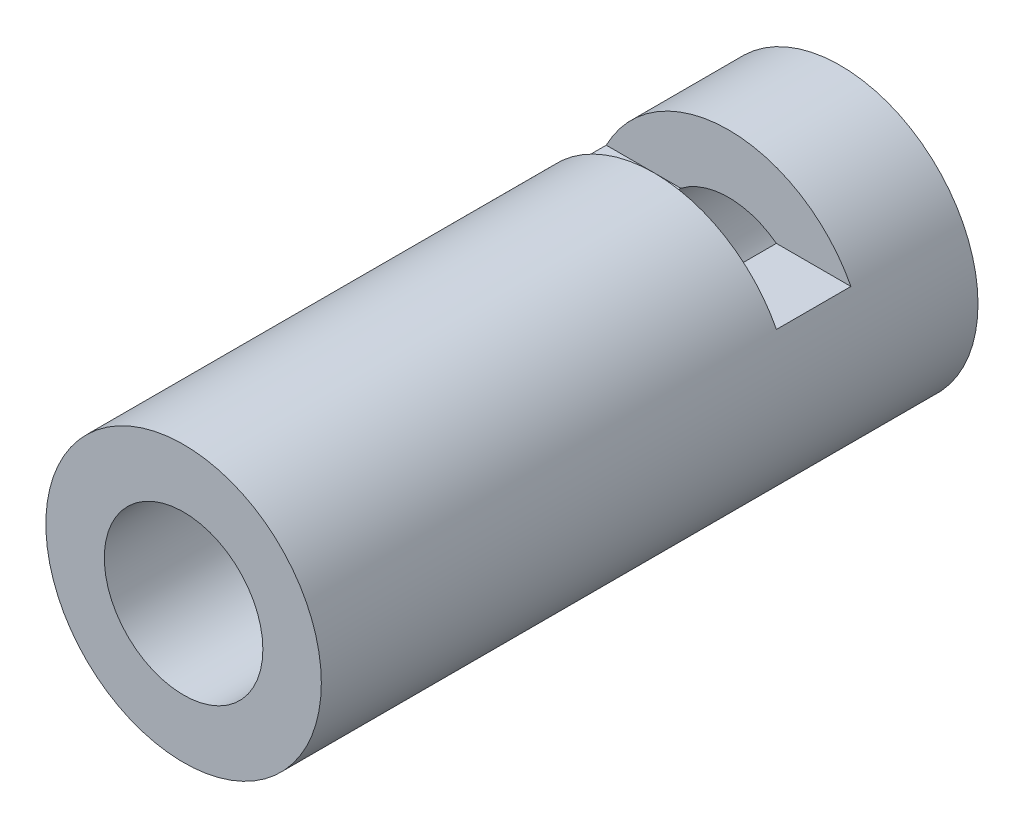
ISO-10303-21;
HEADER;
FILE_DESCRIPTION(('STEP AP214'),'2;1');
FILE_NAME('part.step','',(''),(''),'','','');
FILE_SCHEMA(('AUTOMOTIVE_DESIGN { 1 0 10303 214 1 1 1 1 }'));
ENDSEC;
DATA;
#1=APPLICATION_CONTEXT('core data for automotive mechanical design processes');
#2=APPLICATION_PROTOCOL_DEFINITION('international standard','automotive_design',2000,#1);
#3=PRODUCT_CONTEXT('',#1,'mechanical');
#4=PRODUCT('Part','Part','',(#3));
#5=PRODUCT_RELATED_PRODUCT_CATEGORY('part','',(#4));
#6=PRODUCT_DEFINITION_FORMATION('','',#4);
#7=PRODUCT_DEFINITION_CONTEXT('part definition',#1,'design');
#8=PRODUCT_DEFINITION('design','',#6,#7);
#9=PRODUCT_DEFINITION_SHAPE('','',#8);
#10=(LENGTH_UNIT() NAMED_UNIT(*) SI_UNIT(.MILLI.,.METRE.));
#11=(NAMED_UNIT(*) PLANE_ANGLE_UNIT() SI_UNIT($,.RADIAN.));
#12=(NAMED_UNIT(*) SI_UNIT($,.STERADIAN.) SOLID_ANGLE_UNIT());
#13=UNCERTAINTY_MEASURE_WITH_UNIT(LENGTH_MEASURE(1.E-05),#10,'distance_accuracy_value','');
#14=(GEOMETRIC_REPRESENTATION_CONTEXT(3) GLOBAL_UNCERTAINTY_ASSIGNED_CONTEXT((#13)) GLOBAL_UNIT_ASSIGNED_CONTEXT((#10,
#11,#12)) REPRESENTATION_CONTEXT('',''));
#15=CARTESIAN_POINT('',(0.,0.,0.));
#16=DIRECTION('',(0.,0.,1.));
#17=DIRECTION('',(1.,0.,0.));
#18=AXIS2_PLACEMENT_3D('',#15,#16,#17);
#19=CARTESIAN_POINT('',(0.,0.,88.2));
#20=DIRECTION('',(0.,0.,1.));
#21=DIRECTION('',(1.,0.,0.));
#22=AXIS2_PLACEMENT_3D('',#19,#20,#21);
#23=PLANE('',#22);
#24=CARTESIAN_POINT('',(0.,0.,88.2));
#25=DIRECTION('',(0.,0.,1.));
#26=DIRECTION('',(1.,0.,0.));
#27=AXIS2_PLACEMENT_3D('',#24,#25,#26);
#28=CIRCLE('',#27,18.5);
#29=CARTESIAN_POINT('',(18.5,0.,88.2));
#30=VERTEX_POINT('',#29);
#31=EDGE_CURVE('E80',#30,#30,#28,.T.);
#32=ORIENTED_EDGE('',*,*,#31,.T.);
#33=EDGE_LOOP('',(#32));
#34=FACE_BOUND('',#33,.T.);
#35=CARTESIAN_POINT('',(0.,0.,88.2));
#36=DIRECTION('',(0.,0.,1.));
#37=DIRECTION('',(1.,0.,0.));
#38=AXIS2_PLACEMENT_3D('',#35,#36,#37);
#39=CIRCLE('',#38,10.65);
#40=CARTESIAN_POINT('',(10.65,0.,88.2));
#41=VERTEX_POINT('',#40);
#42=EDGE_CURVE('E97',#41,#41,#39,.T.);
#43=ORIENTED_EDGE('',*,*,#42,.F.);
#44=EDGE_LOOP('',(#43));
#45=FACE_BOUND('',#44,.T.);
#46=ADVANCED_FACE('F32',(#34,#45),#23,.T.);
#47=CARTESIAN_POINT('',(0.,0.,0.));
#48=DIRECTION('',(0.,0.,1.));
#49=DIRECTION('',(1.,0.,0.));
#50=AXIS2_PLACEMENT_3D('',#47,#48,#49);
#51=PLANE('',#50);
#52=CARTESIAN_POINT('',(0.,0.,0.));
#53=DIRECTION('',(0.,0.,1.));
#54=DIRECTION('',(1.,0.,0.));
#55=AXIS2_PLACEMENT_3D('',#52,#53,#54);
#56=CIRCLE('',#55,18.5);
#57=CARTESIAN_POINT('',(18.5,0.,0.));
#58=VERTEX_POINT('',#57);
#59=EDGE_CURVE('E94',#58,#58,#56,.T.);
#60=ORIENTED_EDGE('',*,*,#59,.F.);
#61=EDGE_LOOP('',(#60));
#62=FACE_BOUND('',#61,.T.);
#63=CARTESIAN_POINT('',(0.,0.,0.));
#64=DIRECTION('',(0.,0.,1.));
#65=DIRECTION('',(1.,0.,0.));
#66=AXIS2_PLACEMENT_3D('',#63,#64,#65);
#67=CIRCLE('',#66,10.65);
#68=CARTESIAN_POINT('',(10.65,0.,0.));
#69=VERTEX_POINT('',#68);
#70=EDGE_CURVE('E100',#69,#69,#67,.T.);
#71=ORIENTED_EDGE('',*,*,#70,.T.);
#72=EDGE_LOOP('',(#71));
#73=FACE_BOUND('',#72,.T.);
#74=ADVANCED_FACE('F128',(#62,#73),#51,.F.);
#75=CARTESIAN_POINT('',(0.,0.,88.2));
#76=DIRECTION('',(0.,0.,-1.));
#77=DIRECTION('',(-1.,0.,0.));
#78=AXIS2_PLACEMENT_3D('',#75,#76,#77);
#79=CYLINDRICAL_SURFACE('',#78,18.5);
#80=DIRECTION('',(0.,0.,-1.));
#81=VECTOR('',#80,1.);
#82=CARTESIAN_POINT('',(16.431676725155,8.49999999999999,88.2));
#83=LINE('',#82,#81);
#84=CARTESIAN_POINT('',(16.431676725155,8.5,15.));
#85=VERTEX_POINT('',#84);
#86=CARTESIAN_POINT('',(16.431676725155,8.5,25.));
#87=VERTEX_POINT('',#86);
#88=EDGE_CURVE('E108',#85,#87,#83,.F.);
#89=ORIENTED_EDGE('',*,*,#88,.T.);
#90=CARTESIAN_POINT('',(0.,0.,25.));
#91=DIRECTION('',(0.,0.,1.));
#92=DIRECTION('',(0.,-1.,0.));
#93=AXIS2_PLACEMENT_3D('',#90,#91,#92);
#94=CIRCLE('',#93,18.5);
#95=CARTESIAN_POINT('',(-16.431676725155,8.5,25.));
#96=VERTEX_POINT('',#95);
#97=EDGE_CURVE('E47',#87,#96,#94,.T.);
#98=ORIENTED_EDGE('',*,*,#97,.T.);
#99=DIRECTION('',(0.,0.,-1.));
#100=VECTOR('',#99,1.);
#101=CARTESIAN_POINT('',(-16.431676725155,8.49999999999999,88.2));
#102=LINE('',#101,#100);
#103=CARTESIAN_POINT('',(-16.431676725155,8.5,15.));
#104=VERTEX_POINT('',#103);
#105=EDGE_CURVE('E86',#96,#104,#102,.T.);
#106=ORIENTED_EDGE('',*,*,#105,.T.);
#107=CARTESIAN_POINT('',(0.,0.,15.));
#108=DIRECTION('',(0.,0.,-1.));
#109=DIRECTION('',(0.,1.,0.));
#110=AXIS2_PLACEMENT_3D('',#107,#108,#109);
#111=CIRCLE('',#110,18.5);
#112=EDGE_CURVE('E103',#104,#85,#111,.T.);
#113=ORIENTED_EDGE('',*,*,#112,.T.);
#114=EDGE_LOOP('',(#89,#98,#106,#113));
#115=FACE_BOUND('',#114,.T.);
#116=ORIENTED_EDGE('',*,*,#31,.F.);
#117=EDGE_LOOP('',(#116));
#118=FACE_BOUND('',#117,.T.);
#119=ORIENTED_EDGE('',*,*,#59,.T.);
#120=EDGE_LOOP('',(#119));
#121=FACE_BOUND('',#120,.T.);
#122=ADVANCED_FACE('F34',(#115,#118,#121),#79,.T.);
#123=CARTESIAN_POINT('',(0.,0.,88.2));
#124=DIRECTION('',(0.,0.,-1.));
#125=DIRECTION('',(-1.,0.,0.));
#126=AXIS2_PLACEMENT_3D('',#123,#124,#125);
#127=CYLINDRICAL_SURFACE('',#126,10.65);
#128=CARTESIAN_POINT('',(0.,0.,15.));
#129=DIRECTION('',(0.,0.,-1.));
#130=DIRECTION('',(0.,1.,0.));
#131=AXIS2_PLACEMENT_3D('',#128,#129,#130);
#132=CIRCLE('',#131,10.65);
#133=CARTESIAN_POINT('',(-6.41658008599598,8.5,15.));
#134=VERTEX_POINT('',#133);
#135=CARTESIAN_POINT('',(6.41658008599598,8.5,15.));
#136=VERTEX_POINT('',#135);
#137=EDGE_CURVE('E11',#134,#136,#132,.T.);
#138=ORIENTED_EDGE('',*,*,#137,.F.);
#139=DIRECTION('',(0.,0.,-1.));
#140=VECTOR('',#139,1.);
#141=CARTESIAN_POINT('',(-6.41658008599598,8.49999999999999,88.2));
#142=LINE('',#141,#140);
#143=CARTESIAN_POINT('',(-6.41658008599597,8.5,25.));
#144=VERTEX_POINT('',#143);
#145=EDGE_CURVE('E40',#144,#134,#142,.T.);
#146=ORIENTED_EDGE('',*,*,#145,.F.);
#147=CARTESIAN_POINT('',(0.,0.,25.));
#148=DIRECTION('',(0.,0.,1.));
#149=DIRECTION('',(0.,-1.,0.));
#150=AXIS2_PLACEMENT_3D('',#147,#148,#149);
#151=CIRCLE('',#150,10.65);
#152=CARTESIAN_POINT('',(6.41658008599597,8.5,25.));
#153=VERTEX_POINT('',#152);
#154=EDGE_CURVE('E71',#153,#144,#151,.T.);
#155=ORIENTED_EDGE('',*,*,#154,.F.);
#156=DIRECTION('',(0.,0.,-1.));
#157=VECTOR('',#156,1.);
#158=CARTESIAN_POINT('',(6.41658008599598,8.49999999999999,88.2));
#159=LINE('',#158,#157);
#160=EDGE_CURVE('E79',#136,#153,#159,.F.);
#161=ORIENTED_EDGE('',*,*,#160,.F.);
#162=EDGE_LOOP('',(#138,#146,#155,#161));
#163=FACE_BOUND('',#162,.T.);
#164=ORIENTED_EDGE('',*,*,#42,.T.);
#165=EDGE_LOOP('',(#164));
#166=FACE_BOUND('',#165,.T.);
#167=ORIENTED_EDGE('',*,*,#70,.F.);
#168=EDGE_LOOP('',(#167));
#169=FACE_BOUND('',#168,.T.);
#170=ADVANCED_FACE('F90',(#163,#166,#169),#127,.F.);
#171=CARTESIAN_POINT('',(-18.5,18.5,15.));
#172=DIRECTION('',(0.,0.,-1.));
#173=DIRECTION('',(0.,1.,0.));
#174=AXIS2_PLACEMENT_3D('',#171,#172,#173);
#175=PLANE('',#174);
#176=ORIENTED_EDGE('',*,*,#112,.F.);
#177=DIRECTION('',(1.,0.,0.));
#178=VECTOR('',#177,1.);
#179=CARTESIAN_POINT('',(-18.5,8.5,15.));
#180=LINE('',#179,#178);
#181=EDGE_CURVE('E110',#104,#134,#180,.T.);
#182=ORIENTED_EDGE('',*,*,#181,.T.);
#183=ORIENTED_EDGE('',*,*,#137,.T.);
#184=EDGE_CURVE('E87',#136,#85,#180,.T.);
#185=ORIENTED_EDGE('',*,*,#184,.T.);
#186=EDGE_LOOP('',(#176,#182,#183,#185));
#187=FACE_BOUND('',#186,.T.);
#188=ADVANCED_FACE('F115',(#187),#175,.F.);
#189=CARTESIAN_POINT('',(-18.5,8.5,15.));
#190=DIRECTION('',(0.,-1.,0.));
#191=DIRECTION('',(0.,0.,-1.));
#192=AXIS2_PLACEMENT_3D('',#189,#190,#191);
#193=PLANE('',#192);
#194=DIRECTION('',(1.,0.,0.));
#195=VECTOR('',#194,1.);
#196=CARTESIAN_POINT('',(-18.5,8.5,25.));
#197=LINE('',#196,#195);
#198=EDGE_CURVE('E74',#96,#144,#197,.T.);
#199=ORIENTED_EDGE('',*,*,#198,.T.);
#200=ORIENTED_EDGE('',*,*,#145,.T.);
#201=ORIENTED_EDGE('',*,*,#181,.F.);
#202=ORIENTED_EDGE('',*,*,#105,.F.);
#203=EDGE_LOOP('',(#199,#200,#201,#202));
#204=FACE_BOUND('',#203,.T.);
#205=ADVANCED_FACE('F83',(#204),#193,.F.);
#206=ORIENTED_EDGE('',*,*,#184,.F.);
#207=ORIENTED_EDGE('',*,*,#160,.T.);
#208=EDGE_CURVE('E54',#153,#87,#197,.T.);
#209=ORIENTED_EDGE('',*,*,#208,.T.);
#210=ORIENTED_EDGE('',*,*,#88,.F.);
#211=EDGE_LOOP('',(#206,#207,#209,#210));
#212=FACE_BOUND('',#211,.T.);
#213=ADVANCED_FACE('F119',(#212),#193,.F.);
#214=CARTESIAN_POINT('',(-18.5,18.5,25.));
#215=DIRECTION('',(0.,0.,1.));
#216=DIRECTION('',(0.,-1.,0.));
#217=AXIS2_PLACEMENT_3D('',#214,#215,#216);
#218=PLANE('',#217);
#219=ORIENTED_EDGE('',*,*,#208,.F.);
#220=ORIENTED_EDGE('',*,*,#154,.T.);
#221=ORIENTED_EDGE('',*,*,#198,.F.);
#222=ORIENTED_EDGE('',*,*,#97,.F.);
#223=EDGE_LOOP('',(#219,#220,#221,#222));
#224=FACE_BOUND('',#223,.T.);
#225=ADVANCED_FACE('F73',(#224),#218,.F.);
#226=CLOSED_SHELL('',(#46,#74,#122,#170,#188,#205,#213,#225));
#227=MANIFOLD_SOLID_BREP('B2',#226);
#228=ADVANCED_BREP_SHAPE_REPRESENTATION('',(#18,#227),#14);
#229=SHAPE_DEFINITION_REPRESENTATION(#9,#228);
ENDSEC;
END-ISO-10303-21;
